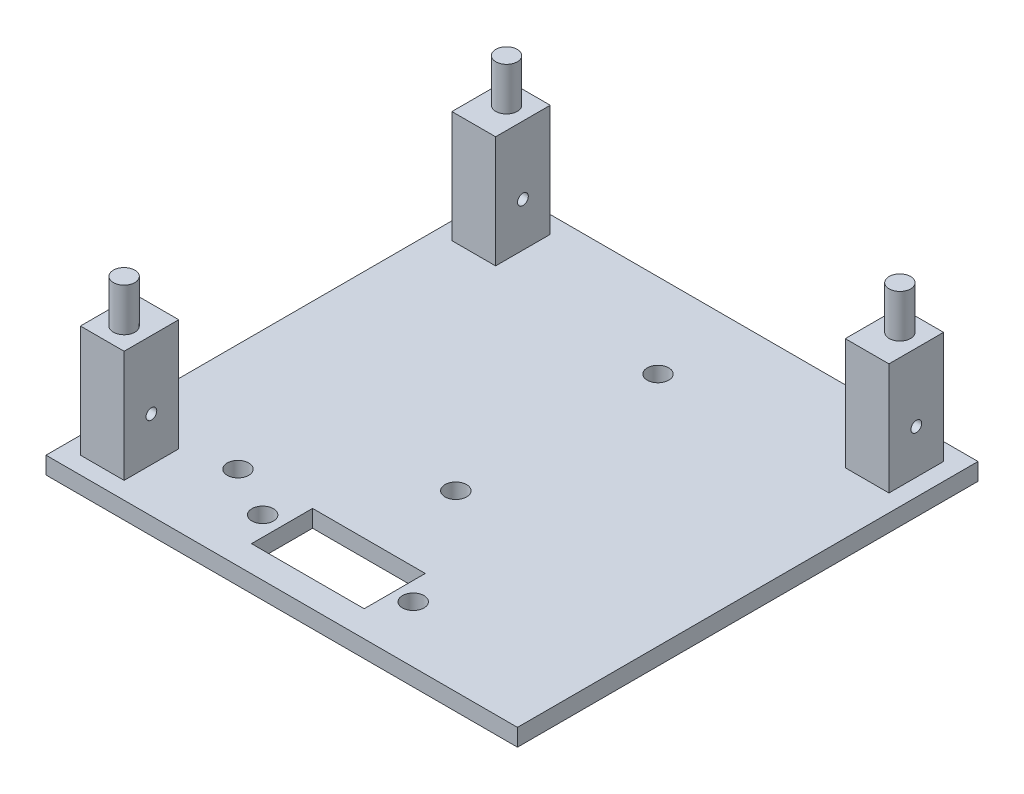
ISO-10303-21;
HEADER;
FILE_DESCRIPTION(('STEP AP214'),'2;1');
FILE_NAME('part.step','',(''),(''),'','','');
FILE_SCHEMA(('AUTOMOTIVE_DESIGN { 1 0 10303 214 1 1 1 1 }'));
ENDSEC;
DATA;
#1=APPLICATION_CONTEXT('core data for automotive mechanical design processes');
#2=APPLICATION_PROTOCOL_DEFINITION('international standard','automotive_design',2000,#1);
#3=PRODUCT_CONTEXT('',#1,'mechanical');
#4=PRODUCT('Part','Part','',(#3));
#5=PRODUCT_RELATED_PRODUCT_CATEGORY('part','',(#4));
#6=PRODUCT_DEFINITION_FORMATION('','',#4);
#7=PRODUCT_DEFINITION_CONTEXT('part definition',#1,'design');
#8=PRODUCT_DEFINITION('design','',#6,#7);
#9=PRODUCT_DEFINITION_SHAPE('','',#8);
#10=(LENGTH_UNIT() NAMED_UNIT(*) SI_UNIT(.MILLI.,.METRE.));
#11=(NAMED_UNIT(*) PLANE_ANGLE_UNIT() SI_UNIT($,.RADIAN.));
#12=(NAMED_UNIT(*) SI_UNIT($,.STERADIAN.) SOLID_ANGLE_UNIT());
#13=UNCERTAINTY_MEASURE_WITH_UNIT(LENGTH_MEASURE(1.E-05),#10,'distance_accuracy_value','');
#14=(GEOMETRIC_REPRESENTATION_CONTEXT(3) GLOBAL_UNCERTAINTY_ASSIGNED_CONTEXT((#13)) GLOBAL_UNIT_ASSIGNED_CONTEXT((#10,
#11,#12)) REPRESENTATION_CONTEXT('',''));
#15=CARTESIAN_POINT('',(0.,0.,0.));
#16=DIRECTION('',(0.,0.,1.));
#17=DIRECTION('',(1.,0.,0.));
#18=AXIS2_PLACEMENT_3D('',#15,#16,#17);
#19=CARTESIAN_POINT('',(0.,15.,0.));
#20=DIRECTION('',(0.,1.,0.));
#21=DIRECTION('',(0.,0.,1.));
#22=AXIS2_PLACEMENT_3D('',#19,#20,#21);
#23=PLANE('',#22);
#24=DIRECTION('',(0.,0.,1.));
#25=VECTOR('',#24,1.);
#26=CARTESIAN_POINT('',(-25.4,15.,24.765));
#27=LINE('',#26,#25);
#28=CARTESIAN_POINT('',(-25.4,15.,18.415));
#29=VERTEX_POINT('',#28);
#30=CARTESIAN_POINT('',(-25.4,15.,24.765));
#31=VERTEX_POINT('',#30);
#32=EDGE_CURVE('E222',#29,#31,#27,.T.);
#33=ORIENTED_EDGE('',*,*,#32,.T.);
#34=DIRECTION('',(1.,0.,0.));
#35=VECTOR('',#34,1.);
#36=CARTESIAN_POINT('',(-20.32,15.,24.765));
#37=LINE('',#36,#35);
#38=CARTESIAN_POINT('',(-20.32,15.,24.765));
#39=VERTEX_POINT('',#38);
#40=EDGE_CURVE('E225',#31,#39,#37,.T.);
#41=ORIENTED_EDGE('',*,*,#40,.T.);
#42=DIRECTION('',(0.,0.,-1.));
#43=VECTOR('',#42,1.);
#44=CARTESIAN_POINT('',(-20.32,15.,24.765));
#45=LINE('',#44,#43);
#46=CARTESIAN_POINT('',(-20.32,15.,18.415));
#47=VERTEX_POINT('',#46);
#48=EDGE_CURVE('E228',#39,#47,#45,.T.);
#49=ORIENTED_EDGE('',*,*,#48,.T.);
#50=DIRECTION('',(-1.,0.,0.));
#51=VECTOR('',#50,1.);
#52=CARTESIAN_POINT('',(-20.32,15.,18.415));
#53=LINE('',#52,#51);
#54=EDGE_CURVE('E230',#47,#29,#53,.T.);
#55=ORIENTED_EDGE('',*,*,#54,.T.);
#56=EDGE_LOOP('',(#33,#41,#49,#55));
#57=FACE_BOUND('',#56,.T.);
#58=CARTESIAN_POINT('',(-22.86,15.,22.225));
#59=DIRECTION('',(0.,1.,0.));
#60=DIRECTION('',(0.,0.,1.));
#61=AXIS2_PLACEMENT_3D('',#58,#59,#60);
#62=CIRCLE('',#61,1.25);
#63=CARTESIAN_POINT('',(-22.86,15.,23.475));
#64=VERTEX_POINT('',#63);
#65=EDGE_CURVE('E175',#64,#64,#62,.T.);
#66=ORIENTED_EDGE('',*,*,#65,.F.);
#67=EDGE_LOOP('',(#66));
#68=FACE_BOUND('',#67,.T.);
#69=ADVANCED_FACE('F32',(#57,#68),#23,.T.);
#70=CARTESIAN_POINT('',(0.,15.,0.));
#71=DIRECTION('',(0.,1.,0.));
#72=DIRECTION('',(0.,0.,1.));
#73=AXIS2_PLACEMENT_3D('',#70,#71,#72);
#74=PLANE('',#73);
#75=DIRECTION('',(0.,0.,1.));
#76=VECTOR('',#75,1.);
#77=CARTESIAN_POINT('',(20.32,15.,-18.415));
#78=LINE('',#77,#76);
#79=CARTESIAN_POINT('',(20.32,15.,-24.765));
#80=VERTEX_POINT('',#79);
#81=CARTESIAN_POINT('',(20.32,15.,-18.415));
#82=VERTEX_POINT('',#81);
#83=EDGE_CURVE('E251',#80,#82,#78,.T.);
#84=ORIENTED_EDGE('',*,*,#83,.T.);
#85=DIRECTION('',(1.,0.,0.));
#86=VECTOR('',#85,1.);
#87=CARTESIAN_POINT('',(25.4,15.,-18.415));
#88=LINE('',#87,#86);
#89=CARTESIAN_POINT('',(25.4,15.,-18.415));
#90=VERTEX_POINT('',#89);
#91=EDGE_CURVE('E254',#82,#90,#88,.T.);
#92=ORIENTED_EDGE('',*,*,#91,.T.);
#93=DIRECTION('',(0.,0.,-1.));
#94=VECTOR('',#93,1.);
#95=CARTESIAN_POINT('',(25.4,15.,-18.415));
#96=LINE('',#95,#94);
#97=CARTESIAN_POINT('',(25.4,15.,-24.765));
#98=VERTEX_POINT('',#97);
#99=EDGE_CURVE('E257',#90,#98,#96,.T.);
#100=ORIENTED_EDGE('',*,*,#99,.T.);
#101=DIRECTION('',(-1.,0.,0.));
#102=VECTOR('',#101,1.);
#103=CARTESIAN_POINT('',(25.4,15.,-24.765));
#104=LINE('',#103,#102);
#105=EDGE_CURVE('E259',#98,#80,#104,.T.);
#106=ORIENTED_EDGE('',*,*,#105,.T.);
#107=EDGE_LOOP('',(#84,#92,#100,#106));
#108=FACE_BOUND('',#107,.T.);
#109=CARTESIAN_POINT('',(22.86,15.,-22.225));
#110=DIRECTION('',(0.,1.,0.));
#111=DIRECTION('',(0.,0.,1.));
#112=AXIS2_PLACEMENT_3D('',#109,#110,#111);
#113=CIRCLE('',#112,1.25);
#114=CARTESIAN_POINT('',(22.86,15.,-20.975));
#115=VERTEX_POINT('',#114);
#116=EDGE_CURVE('E207',#115,#115,#113,.T.);
#117=ORIENTED_EDGE('',*,*,#116,.F.);
#118=EDGE_LOOP('',(#117));
#119=FACE_BOUND('',#118,.T.);
#120=ADVANCED_FACE('F360',(#108,#119),#74,.T.);
#121=CARTESIAN_POINT('',(0.,15.,0.));
#122=DIRECTION('',(0.,1.,0.));
#123=DIRECTION('',(0.,0.,1.));
#124=AXIS2_PLACEMENT_3D('',#121,#122,#123);
#125=PLANE('',#124);
#126=DIRECTION('',(0.,0.,1.));
#127=VECTOR('',#126,1.);
#128=CARTESIAN_POINT('',(-25.4,15.,-18.415));
#129=LINE('',#128,#127);
#130=CARTESIAN_POINT('',(-25.4,15.,-24.765));
#131=VERTEX_POINT('',#130);
#132=CARTESIAN_POINT('',(-25.4,15.,-18.415));
#133=VERTEX_POINT('',#132);
#134=EDGE_CURVE('E280',#131,#133,#129,.T.);
#135=ORIENTED_EDGE('',*,*,#134,.T.);
#136=DIRECTION('',(1.,0.,0.));
#137=VECTOR('',#136,1.);
#138=CARTESIAN_POINT('',(-20.32,15.,-18.415));
#139=LINE('',#138,#137);
#140=CARTESIAN_POINT('',(-20.32,15.,-18.415));
#141=VERTEX_POINT('',#140);
#142=EDGE_CURVE('E283',#133,#141,#139,.T.);
#143=ORIENTED_EDGE('',*,*,#142,.T.);
#144=DIRECTION('',(0.,0.,-1.));
#145=VECTOR('',#144,1.);
#146=CARTESIAN_POINT('',(-20.32,15.,-18.415));
#147=LINE('',#146,#145);
#148=CARTESIAN_POINT('',(-20.32,15.,-24.765));
#149=VERTEX_POINT('',#148);
#150=EDGE_CURVE('E286',#141,#149,#147,.T.);
#151=ORIENTED_EDGE('',*,*,#150,.T.);
#152=DIRECTION('',(-1.,0.,0.));
#153=VECTOR('',#152,1.);
#154=CARTESIAN_POINT('',(-20.32,15.,-24.765));
#155=LINE('',#154,#153);
#156=EDGE_CURVE('E288',#149,#131,#155,.T.);
#157=ORIENTED_EDGE('',*,*,#156,.T.);
#158=EDGE_LOOP('',(#135,#143,#151,#157));
#159=FACE_BOUND('',#158,.T.);
#160=CARTESIAN_POINT('',(-22.86,15.,-22.225));
#161=DIRECTION('',(0.,1.,0.));
#162=DIRECTION('',(0.,0.,1.));
#163=AXIS2_PLACEMENT_3D('',#160,#161,#162);
#164=CIRCLE('',#163,1.25);
#165=CARTESIAN_POINT('',(-22.86,15.,-20.975));
#166=VERTEX_POINT('',#165);
#167=EDGE_CURVE('E213',#166,#166,#164,.T.);
#168=ORIENTED_EDGE('',*,*,#167,.F.);
#169=EDGE_LOOP('',(#168));
#170=FACE_BOUND('',#169,.T.);
#171=ADVANCED_FACE('F366',(#159,#170),#125,.T.);
#172=CARTESIAN_POINT('',(0.,2.,0.));
#173=DIRECTION('',(0.,1.,0.));
#174=DIRECTION('',(0.,0.,1.));
#175=AXIS2_PLACEMENT_3D('',#172,#173,#174);
#176=PLANE('',#175);
#177=CARTESIAN_POINT('',(8.7,2.,20.1805963193399));
#178=DIRECTION('',(0.,1.,0.));
#179=DIRECTION('',(0.,0.,1.));
#180=AXIS2_PLACEMENT_3D('',#177,#178,#179);
#181=CIRCLE('',#180,1.25);
#182=CARTESIAN_POINT('',(8.7,2.,21.4305963193399));
#183=VERTEX_POINT('',#182);
#184=EDGE_CURVE('E730',#183,#183,#181,.T.);
#185=ORIENTED_EDGE('',*,*,#184,.F.);
#186=EDGE_LOOP('',(#185));
#187=FACE_BOUND('',#186,.T.);
#188=CARTESIAN_POINT('',(-8.8,2.,20.1805963193399));
#189=DIRECTION('',(0.,1.,0.));
#190=DIRECTION('',(0.,0.,1.));
#191=AXIS2_PLACEMENT_3D('',#188,#189,#190);
#192=CIRCLE('',#191,1.25);
#193=CARTESIAN_POINT('',(-8.8,2.,21.4305963193399));
#194=VERTEX_POINT('',#193);
#195=EDGE_CURVE('E734',#194,#194,#192,.T.);
#196=ORIENTED_EDGE('',*,*,#195,.F.);
#197=EDGE_LOOP('',(#196));
#198=FACE_BOUND('',#197,.T.);
#199=CARTESIAN_POINT('',(-14.8354654023255,2.,17.0171514909028));
#200=DIRECTION('',(0.,1.,0.));
#201=DIRECTION('',(0.,0.,1.));
#202=AXIS2_PLACEMENT_3D('',#199,#200,#201);
#203=CIRCLE('',#202,1.25);
#204=CARTESIAN_POINT('',(-14.8354654023255,2.,18.2671514909028));
#205=VERTEX_POINT('',#204);
#206=EDGE_CURVE('E743',#205,#205,#203,.T.);
#207=ORIENTED_EDGE('',*,*,#206,.F.);
#208=EDGE_LOOP('',(#207));
#209=FACE_BOUND('',#208,.T.);
#210=CARTESIAN_POINT('',(0.,2.,-16.9691941928565));
#211=DIRECTION('',(0.,1.,0.));
#212=DIRECTION('',(0.,0.,1.));
#213=AXIS2_PLACEMENT_3D('',#210,#211,#212);
#214=CIRCLE('',#213,1.25);
#215=CARTESIAN_POINT('',(0.,2.,-15.7191941928565));
#216=VERTEX_POINT('',#215);
#217=EDGE_CURVE('E765',#216,#216,#214,.F.);
#218=ORIENTED_EDGE('',*,*,#217,.T.);
#219=EDGE_LOOP('',(#218));
#220=FACE_BOUND('',#219,.T.);
#221=CARTESIAN_POINT('',(0.,2.,6.53080580714353));
#222=DIRECTION('',(0.,1.,0.));
#223=DIRECTION('',(0.,0.,1.));
#224=AXIS2_PLACEMENT_3D('',#221,#222,#223);
#225=CIRCLE('',#224,1.25);
#226=CARTESIAN_POINT('',(0.,2.,7.78080580714353));
#227=VERTEX_POINT('',#226);
#228=EDGE_CURVE('E771',#227,#227,#225,.F.);
#229=ORIENTED_EDGE('',*,*,#228,.T.);
#230=EDGE_LOOP('',(#229));
#231=FACE_BOUND('',#230,.T.);
#232=DIRECTION('',(0.,0.,1.));
#233=VECTOR('',#232,1.);
#234=CARTESIAN_POINT('',(6.55,2.,23.7305963193399));
#235=LINE('',#234,#233);
#236=CARTESIAN_POINT('',(6.55,2.,16.6305963193399));
#237=VERTEX_POINT('',#236);
#238=CARTESIAN_POINT('',(6.55,2.,23.7305963193399));
#239=VERTEX_POINT('',#238);
#240=EDGE_CURVE('E179',#237,#239,#235,.T.);
#241=ORIENTED_EDGE('',*,*,#240,.T.);
#242=DIRECTION('',(-1.,0.,0.));
#243=VECTOR('',#242,1.);
#244=CARTESIAN_POINT('',(-6.55,2.,23.7305963193399));
#245=LINE('',#244,#243);
#246=CARTESIAN_POINT('',(-6.55,2.,23.7305963193399));
#247=VERTEX_POINT('',#246);
#248=EDGE_CURVE('E168',#239,#247,#245,.T.);
#249=ORIENTED_EDGE('',*,*,#248,.T.);
#250=DIRECTION('',(0.,0.,-1.));
#251=VECTOR('',#250,1.);
#252=CARTESIAN_POINT('',(-6.55,2.,23.7305963193399));
#253=LINE('',#252,#251);
#254=CARTESIAN_POINT('',(-6.55,2.,16.6305963193399));
#255=VERTEX_POINT('',#254);
#256=EDGE_CURVE('E190',#247,#255,#253,.T.);
#257=ORIENTED_EDGE('',*,*,#256,.T.);
#258=DIRECTION('',(1.,0.,0.));
#259=VECTOR('',#258,1.);
#260=CARTESIAN_POINT('',(-6.55,2.,16.6305963193399));
#261=LINE('',#260,#259);
#262=EDGE_CURVE('E186',#255,#237,#261,.T.);
#263=ORIENTED_EDGE('',*,*,#262,.T.);
#264=EDGE_LOOP('',(#241,#249,#257,#263));
#265=FACE_BOUND('',#264,.T.);
#266=DIRECTION('',(1.,0.,0.));
#267=VECTOR('',#266,1.);
#268=CARTESIAN_POINT('',(25.4,2.,-18.415));
#269=LINE('',#268,#267);
#270=CARTESIAN_POINT('',(20.32,2.,-18.415));
#271=VERTEX_POINT('',#270);
#272=CARTESIAN_POINT('',(25.4,2.,-18.415));
#273=VERTEX_POINT('',#272);
#274=EDGE_CURVE('E264',#271,#273,#269,.T.);
#275=ORIENTED_EDGE('',*,*,#274,.F.);
#276=DIRECTION('',(0.,0.,1.));
#277=VECTOR('',#276,1.);
#278=CARTESIAN_POINT('',(20.32,2.,-18.415));
#279=LINE('',#278,#277);
#280=CARTESIAN_POINT('',(20.32,2.,-24.765));
#281=VERTEX_POINT('',#280);
#282=EDGE_CURVE('E250',#281,#271,#279,.T.);
#283=ORIENTED_EDGE('',*,*,#282,.F.);
#284=DIRECTION('',(-1.,0.,0.));
#285=VECTOR('',#284,1.);
#286=CARTESIAN_POINT('',(25.4,2.,-24.765));
#287=LINE('',#286,#285);
#288=CARTESIAN_POINT('',(25.4,2.,-24.765));
#289=VERTEX_POINT('',#288);
#290=EDGE_CURVE('E255',#289,#281,#287,.T.);
#291=ORIENTED_EDGE('',*,*,#290,.F.);
#292=DIRECTION('',(0.,0.,-1.));
#293=VECTOR('',#292,1.);
#294=CARTESIAN_POINT('',(25.4,2.,-18.415));
#295=LINE('',#294,#293);
#296=EDGE_CURVE('E266',#273,#289,#295,.T.);
#297=ORIENTED_EDGE('',*,*,#296,.F.);
#298=EDGE_LOOP('',(#275,#283,#291,#297));
#299=FACE_BOUND('',#298,.T.);
#300=DIRECTION('',(0.,0.,1.));
#301=VECTOR('',#300,1.);
#302=CARTESIAN_POINT('',(-27.4,2.,26.765));
#303=LINE('',#302,#301);
#304=CARTESIAN_POINT('',(-27.4,2.,-26.765));
#305=VERTEX_POINT('',#304);
#306=CARTESIAN_POINT('',(-27.4,2.,26.765));
#307=VERTEX_POINT('',#306);
#308=EDGE_CURVE('E309',#305,#307,#303,.T.);
#309=ORIENTED_EDGE('',*,*,#308,.T.);
#310=DIRECTION('',(1.,0.,0.));
#311=VECTOR('',#310,1.);
#312=CARTESIAN_POINT('',(27.4,2.,26.765));
#313=LINE('',#312,#311);
#314=CARTESIAN_POINT('',(27.4,2.,26.765));
#315=VERTEX_POINT('',#314);
#316=EDGE_CURVE('E312',#307,#315,#313,.T.);
#317=ORIENTED_EDGE('',*,*,#316,.T.);
#318=DIRECTION('',(0.,0.,-1.));
#319=VECTOR('',#318,1.);
#320=CARTESIAN_POINT('',(27.4,2.,26.765));
#321=LINE('',#320,#319);
#322=CARTESIAN_POINT('',(27.4,2.,-26.765));
#323=VERTEX_POINT('',#322);
#324=EDGE_CURVE('E315',#315,#323,#321,.T.);
#325=ORIENTED_EDGE('',*,*,#324,.T.);
#326=DIRECTION('',(-1.,0.,0.));
#327=VECTOR('',#326,1.);
#328=CARTESIAN_POINT('',(27.4,2.,-26.765));
#329=LINE('',#328,#327);
#330=EDGE_CURVE('E317',#323,#305,#329,.T.);
#331=ORIENTED_EDGE('',*,*,#330,.T.);
#332=EDGE_LOOP('',(#309,#317,#325,#331));
#333=FACE_BOUND('',#332,.T.);
#334=DIRECTION('',(1.,0.,0.));
#335=VECTOR('',#334,1.);
#336=CARTESIAN_POINT('',(-20.32,2.,-18.415));
#337=LINE('',#336,#335);
#338=CARTESIAN_POINT('',(-25.4,2.,-18.415));
#339=VERTEX_POINT('',#338);
#340=CARTESIAN_POINT('',(-20.32,2.,-18.415));
#341=VERTEX_POINT('',#340);
#342=EDGE_CURVE('E293',#339,#341,#337,.T.);
#343=ORIENTED_EDGE('',*,*,#342,.F.);
#344=DIRECTION('',(0.,0.,1.));
#345=VECTOR('',#344,1.);
#346=CARTESIAN_POINT('',(-25.4,2.,-18.415));
#347=LINE('',#346,#345);
#348=CARTESIAN_POINT('',(-25.4,2.,-24.765));
#349=VERTEX_POINT('',#348);
#350=EDGE_CURVE('E279',#349,#339,#347,.T.);
#351=ORIENTED_EDGE('',*,*,#350,.F.);
#352=DIRECTION('',(-1.,0.,0.));
#353=VECTOR('',#352,1.);
#354=CARTESIAN_POINT('',(-20.32,2.,-24.765));
#355=LINE('',#354,#353);
#356=CARTESIAN_POINT('',(-20.32,2.,-24.765));
#357=VERTEX_POINT('',#356);
#358=EDGE_CURVE('E284',#357,#349,#355,.T.);
#359=ORIENTED_EDGE('',*,*,#358,.F.);
#360=DIRECTION('',(0.,0.,-1.));
#361=VECTOR('',#360,1.);
#362=CARTESIAN_POINT('',(-20.32,2.,-18.415));
#363=LINE('',#362,#361);
#364=EDGE_CURVE('E295',#341,#357,#363,.T.);
#365=ORIENTED_EDGE('',*,*,#364,.F.);
#366=EDGE_LOOP('',(#343,#351,#359,#365));
#367=FACE_BOUND('',#366,.T.);
#368=DIRECTION('',(1.,0.,0.));
#369=VECTOR('',#368,1.);
#370=CARTESIAN_POINT('',(-20.32,2.,24.765));
#371=LINE('',#370,#369);
#372=CARTESIAN_POINT('',(-25.4,2.,24.765));
#373=VERTEX_POINT('',#372);
#374=CARTESIAN_POINT('',(-20.32,2.,24.765));
#375=VERTEX_POINT('',#374);
#376=EDGE_CURVE('E235',#373,#375,#371,.T.);
#377=ORIENTED_EDGE('',*,*,#376,.F.);
#378=DIRECTION('',(0.,0.,1.));
#379=VECTOR('',#378,1.);
#380=CARTESIAN_POINT('',(-25.4,2.,24.765));
#381=LINE('',#380,#379);
#382=CARTESIAN_POINT('',(-25.4,2.,18.415));
#383=VERTEX_POINT('',#382);
#384=EDGE_CURVE('E219',#383,#373,#381,.T.);
#385=ORIENTED_EDGE('',*,*,#384,.F.);
#386=DIRECTION('',(-1.,0.,0.));
#387=VECTOR('',#386,1.);
#388=CARTESIAN_POINT('',(-20.32,2.,18.415));
#389=LINE('',#388,#387);
#390=CARTESIAN_POINT('',(-20.32,2.,18.415));
#391=VERTEX_POINT('',#390);
#392=EDGE_CURVE('E226',#391,#383,#389,.T.);
#393=ORIENTED_EDGE('',*,*,#392,.F.);
#394=DIRECTION('',(0.,0.,-1.));
#395=VECTOR('',#394,1.);
#396=CARTESIAN_POINT('',(-20.32,2.,24.765));
#397=LINE('',#396,#395);
#398=EDGE_CURVE('E237',#375,#391,#397,.T.);
#399=ORIENTED_EDGE('',*,*,#398,.F.);
#400=EDGE_LOOP('',(#377,#385,#393,#399));
#401=FACE_BOUND('',#400,.T.);
#402=ADVANCED_FACE('F184',(#187,#198,#209,#220,#231,#265,#299,#333,#367,#401),#176,.T.);
#403=CARTESIAN_POINT('',(-27.4,2.,26.765));
#404=DIRECTION('',(1.,0.,0.));
#405=DIRECTION('',(0.,0.,-1.));
#406=AXIS2_PLACEMENT_3D('',#403,#404,#405);
#407=PLANE('',#406);
#408=DIRECTION('',(0.,0.,1.));
#409=VECTOR('',#408,1.);
#410=CARTESIAN_POINT('',(-27.4,0.,26.765));
#411=LINE('',#410,#409);
#412=CARTESIAN_POINT('',(-27.4,0.,-26.765));
#413=VERTEX_POINT('',#412);
#414=CARTESIAN_POINT('',(-27.4,0.,26.765));
#415=VERTEX_POINT('',#414);
#416=EDGE_CURVE('E308',#413,#415,#411,.T.);
#417=ORIENTED_EDGE('',*,*,#416,.T.);
#418=DIRECTION('',(0.,-1.,0.));
#419=VECTOR('',#418,1.);
#420=CARTESIAN_POINT('',(-27.4,2.,26.765));
#421=LINE('',#420,#419);
#422=EDGE_CURVE('E11',#307,#415,#421,.T.);
#423=ORIENTED_EDGE('',*,*,#422,.F.);
#424=ORIENTED_EDGE('',*,*,#308,.F.);
#425=DIRECTION('',(0.,-1.,0.));
#426=VECTOR('',#425,1.);
#427=CARTESIAN_POINT('',(-27.4,2.,-26.765));
#428=LINE('',#427,#426);
#429=EDGE_CURVE('E319',#305,#413,#428,.T.);
#430=ORIENTED_EDGE('',*,*,#429,.T.);
#431=EDGE_LOOP('',(#417,#423,#424,#430));
#432=FACE_BOUND('',#431,.T.);
#433=ADVANCED_FACE('F34',(#432),#407,.F.);
#434=CARTESIAN_POINT('',(27.4,2.,26.765));
#435=DIRECTION('',(0.,0.,-1.));
#436=DIRECTION('',(-1.,0.,0.));
#437=AXIS2_PLACEMENT_3D('',#434,#435,#436);
#438=PLANE('',#437);
#439=DIRECTION('',(1.,0.,0.));
#440=VECTOR('',#439,1.);
#441=CARTESIAN_POINT('',(27.4,0.,26.765));
#442=LINE('',#441,#440);
#443=CARTESIAN_POINT('',(27.4,0.,26.765));
#444=VERTEX_POINT('',#443);
#445=EDGE_CURVE('E322',#415,#444,#442,.T.);
#446=ORIENTED_EDGE('',*,*,#445,.T.);
#447=DIRECTION('',(0.,-1.,0.));
#448=VECTOR('',#447,1.);
#449=CARTESIAN_POINT('',(27.4,2.,26.765));
#450=LINE('',#449,#448);
#451=EDGE_CURVE('E40',#315,#444,#450,.T.);
#452=ORIENTED_EDGE('',*,*,#451,.F.);
#453=ORIENTED_EDGE('',*,*,#316,.F.);
#454=ORIENTED_EDGE('',*,*,#422,.T.);
#455=EDGE_LOOP('',(#446,#452,#453,#454));
#456=FACE_BOUND('',#455,.T.);
#457=ADVANCED_FACE('F352',(#456),#438,.F.);
#458=CARTESIAN_POINT('',(27.4,2.,26.765));
#459=DIRECTION('',(-1.,0.,0.));
#460=DIRECTION('',(0.,0.,1.));
#461=AXIS2_PLACEMENT_3D('',#458,#459,#460);
#462=PLANE('',#461);
#463=DIRECTION('',(0.,0.,-1.));
#464=VECTOR('',#463,1.);
#465=CARTESIAN_POINT('',(27.4,0.,26.765));
#466=LINE('',#465,#464);
#467=CARTESIAN_POINT('',(27.4,0.,-26.765));
#468=VERTEX_POINT('',#467);
#469=EDGE_CURVE('E324',#444,#468,#466,.T.);
#470=ORIENTED_EDGE('',*,*,#469,.T.);
#471=DIRECTION('',(0.,-1.,0.));
#472=VECTOR('',#471,1.);
#473=CARTESIAN_POINT('',(27.4,2.,-26.765));
#474=LINE('',#473,#472);
#475=EDGE_CURVE('E329',#323,#468,#474,.T.);
#476=ORIENTED_EDGE('',*,*,#475,.F.);
#477=ORIENTED_EDGE('',*,*,#324,.F.);
#478=ORIENTED_EDGE('',*,*,#451,.T.);
#479=EDGE_LOOP('',(#470,#476,#477,#478));
#480=FACE_BOUND('',#479,.T.);
#481=ADVANCED_FACE('F336',(#480),#462,.F.);
#482=CARTESIAN_POINT('',(27.4,2.,-26.765));
#483=DIRECTION('',(0.,0.,1.));
#484=DIRECTION('',(1.,0.,0.));
#485=AXIS2_PLACEMENT_3D('',#482,#483,#484);
#486=PLANE('',#485);
#487=DIRECTION('',(-1.,0.,0.));
#488=VECTOR('',#487,1.);
#489=CARTESIAN_POINT('',(27.4,0.,-26.765));
#490=LINE('',#489,#488);
#491=EDGE_CURVE('E313',#468,#413,#490,.T.);
#492=ORIENTED_EDGE('',*,*,#491,.T.);
#493=ORIENTED_EDGE('',*,*,#429,.F.);
#494=ORIENTED_EDGE('',*,*,#330,.F.);
#495=ORIENTED_EDGE('',*,*,#475,.T.);
#496=EDGE_LOOP('',(#492,#493,#494,#495));
#497=FACE_BOUND('',#496,.T.);
#498=ADVANCED_FACE('F345',(#497),#486,.F.);
#499=CARTESIAN_POINT('',(0.,0.,0.));
#500=DIRECTION('',(0.,1.,0.));
#501=DIRECTION('',(0.,0.,1.));
#502=AXIS2_PLACEMENT_3D('',#499,#500,#501);
#503=PLANE('',#502);
#504=CARTESIAN_POINT('',(8.7,0.,20.1805963193399));
#505=DIRECTION('',(0.,1.,0.));
#506=DIRECTION('',(0.,0.,1.));
#507=AXIS2_PLACEMENT_3D('',#504,#505,#506);
#508=CIRCLE('',#507,1.25);
#509=CARTESIAN_POINT('',(8.7,0.,21.4305963193399));
#510=VERTEX_POINT('',#509);
#511=EDGE_CURVE('E733',#510,#510,#508,.F.);
#512=ORIENTED_EDGE('',*,*,#511,.F.);
#513=EDGE_LOOP('',(#512));
#514=FACE_BOUND('',#513,.T.);
#515=CARTESIAN_POINT('',(-8.8,0.,20.1805963193399));
#516=DIRECTION('',(0.,1.,0.));
#517=DIRECTION('',(0.,0.,1.));
#518=AXIS2_PLACEMENT_3D('',#515,#516,#517);
#519=CIRCLE('',#518,1.25);
#520=CARTESIAN_POINT('',(-8.8,0.,21.4305963193399));
#521=VERTEX_POINT('',#520);
#522=EDGE_CURVE('E737',#521,#521,#519,.F.);
#523=ORIENTED_EDGE('',*,*,#522,.F.);
#524=EDGE_LOOP('',(#523));
#525=FACE_BOUND('',#524,.T.);
#526=CARTESIAN_POINT('',(-14.8354654023255,0.,17.0171514909028));
#527=DIRECTION('',(0.,1.,0.));
#528=DIRECTION('',(0.,0.,1.));
#529=AXIS2_PLACEMENT_3D('',#526,#527,#528);
#530=CIRCLE('',#529,1.25);
#531=CARTESIAN_POINT('',(-14.8354654023255,0.,18.2671514909028));
#532=VERTEX_POINT('',#531);
#533=EDGE_CURVE('E746',#532,#532,#530,.F.);
#534=ORIENTED_EDGE('',*,*,#533,.F.);
#535=EDGE_LOOP('',(#534));
#536=FACE_BOUND('',#535,.T.);
#537=CARTESIAN_POINT('',(0.,0.,-16.9691941928565));
#538=DIRECTION('',(0.,-1.,0.));
#539=DIRECTION('',(0.,0.,-1.));
#540=AXIS2_PLACEMENT_3D('',#537,#538,#539);
#541=CIRCLE('',#540,1.25);
#542=CARTESIAN_POINT('',(0.,0.,-18.2191941928565));
#543=VERTEX_POINT('',#542);
#544=EDGE_CURVE('E768',#543,#543,#541,.T.);
#545=ORIENTED_EDGE('',*,*,#544,.F.);
#546=EDGE_LOOP('',(#545));
#547=FACE_BOUND('',#546,.T.);
#548=CARTESIAN_POINT('',(0.,0.,6.53080580714353));
#549=DIRECTION('',(0.,-1.,0.));
#550=DIRECTION('',(0.,0.,-1.));
#551=AXIS2_PLACEMENT_3D('',#548,#549,#550);
#552=CIRCLE('',#551,1.25);
#553=CARTESIAN_POINT('',(0.,0.,5.28080580714353));
#554=VERTEX_POINT('',#553);
#555=EDGE_CURVE('E774',#554,#554,#552,.T.);
#556=ORIENTED_EDGE('',*,*,#555,.F.);
#557=EDGE_LOOP('',(#556));
#558=FACE_BOUND('',#557,.T.);
#559=DIRECTION('',(-1.,0.,0.));
#560=VECTOR('',#559,1.);
#561=CARTESIAN_POINT('',(-6.55,0.,23.7305963193399));
#562=LINE('',#561,#560);
#563=CARTESIAN_POINT('',(6.55,0.,23.7305963193399));
#564=VERTEX_POINT('',#563);
#565=CARTESIAN_POINT('',(-6.55,0.,23.7305963193399));
#566=VERTEX_POINT('',#565);
#567=EDGE_CURVE('E188',#564,#566,#562,.T.);
#568=ORIENTED_EDGE('',*,*,#567,.F.);
#569=DIRECTION('',(0.,0.,1.));
#570=VECTOR('',#569,1.);
#571=CARTESIAN_POINT('',(6.55,0.,23.7305963193399));
#572=LINE('',#571,#570);
#573=CARTESIAN_POINT('',(6.55,0.,16.6305963193399));
#574=VERTEX_POINT('',#573);
#575=EDGE_CURVE('E55',#574,#564,#572,.T.);
#576=ORIENTED_EDGE('',*,*,#575,.F.);
#577=DIRECTION('',(1.,0.,0.));
#578=VECTOR('',#577,1.);
#579=CARTESIAN_POINT('',(-6.55,0.,16.6305963193399));
#580=LINE('',#579,#578);
#581=CARTESIAN_POINT('',(-6.55,0.,16.6305963193399));
#582=VERTEX_POINT('',#581);
#583=EDGE_CURVE('E181',#582,#574,#580,.T.);
#584=ORIENTED_EDGE('',*,*,#583,.F.);
#585=DIRECTION('',(0.,0.,-1.));
#586=VECTOR('',#585,1.);
#587=CARTESIAN_POINT('',(-6.55,0.,23.7305963193399));
#588=LINE('',#587,#586);
#589=EDGE_CURVE('E195',#566,#582,#588,.T.);
#590=ORIENTED_EDGE('',*,*,#589,.F.);
#591=EDGE_LOOP('',(#568,#576,#584,#590));
#592=FACE_BOUND('',#591,.T.);
#593=ORIENTED_EDGE('',*,*,#416,.F.);
#594=ORIENTED_EDGE('',*,*,#491,.F.);
#595=ORIENTED_EDGE('',*,*,#469,.F.);
#596=ORIENTED_EDGE('',*,*,#445,.F.);
#597=EDGE_LOOP('',(#593,#594,#595,#596));
#598=FACE_BOUND('',#597,.T.);
#599=ADVANCED_FACE('F342',(#514,#525,#536,#547,#558,#592,#598),#503,.F.);
#600=CARTESIAN_POINT('',(-25.4,15.,-18.415));
#601=DIRECTION('',(1.,0.,0.));
#602=DIRECTION('',(0.,0.,-1.));
#603=AXIS2_PLACEMENT_3D('',#600,#601,#602);
#604=PLANE('',#603);
#605=CARTESIAN_POINT('',(-25.4,7.1147059503016,-21.59));
#606=DIRECTION('',(-1.,0.,0.));
#607=DIRECTION('',(0.,0.,1.));
#608=AXIS2_PLACEMENT_3D('',#605,#606,#607);
#609=CIRCLE('',#608,0.625000000000003);
#610=CARTESIAN_POINT('',(-25.4,7.1147059503016,-20.965));
#611=VERTEX_POINT('',#610);
#612=EDGE_CURVE('E759',#611,#611,#609,.T.);
#613=ORIENTED_EDGE('',*,*,#612,.F.);
#614=EDGE_LOOP('',(#613));
#615=FACE_BOUND('',#614,.T.);
#616=ORIENTED_EDGE('',*,*,#350,.T.);
#617=DIRECTION('',(0.,-1.,0.));
#618=VECTOR('',#617,1.);
#619=CARTESIAN_POINT('',(-25.4,15.,-18.415));
#620=LINE('',#619,#618);
#621=EDGE_CURVE('E306',#133,#339,#620,.T.);
#622=ORIENTED_EDGE('',*,*,#621,.F.);
#623=ORIENTED_EDGE('',*,*,#134,.F.);
#624=DIRECTION('',(0.,-1.,0.));
#625=VECTOR('',#624,1.);
#626=CARTESIAN_POINT('',(-25.4,15.,-24.765));
#627=LINE('',#626,#625);
#628=EDGE_CURVE('E290',#131,#349,#627,.T.);
#629=ORIENTED_EDGE('',*,*,#628,.T.);
#630=EDGE_LOOP('',(#616,#622,#623,#629));
#631=FACE_BOUND('',#630,.T.);
#632=ADVANCED_FACE('F420',(#615,#631),#604,.F.);
#633=CARTESIAN_POINT('',(-20.32,15.,-18.415));
#634=DIRECTION('',(0.,0.,-1.));
#635=DIRECTION('',(-1.,0.,0.));
#636=AXIS2_PLACEMENT_3D('',#633,#634,#635);
#637=PLANE('',#636);
#638=ORIENTED_EDGE('',*,*,#342,.T.);
#639=DIRECTION('',(0.,-1.,0.));
#640=VECTOR('',#639,1.);
#641=CARTESIAN_POINT('',(-20.32,15.,-18.415));
#642=LINE('',#641,#640);
#643=EDGE_CURVE('E303',#141,#341,#642,.T.);
#644=ORIENTED_EDGE('',*,*,#643,.F.);
#645=ORIENTED_EDGE('',*,*,#142,.F.);
#646=ORIENTED_EDGE('',*,*,#621,.T.);
#647=EDGE_LOOP('',(#638,#644,#645,#646));
#648=FACE_BOUND('',#647,.T.);
#649=ADVANCED_FACE('F416',(#648),#637,.F.);
#650=CARTESIAN_POINT('',(-20.32,15.,-18.415));
#651=DIRECTION('',(-1.,0.,0.));
#652=DIRECTION('',(0.,0.,1.));
#653=AXIS2_PLACEMENT_3D('',#650,#651,#652);
#654=PLANE('',#653);
#655=CARTESIAN_POINT('',(-20.32,7.1147059503016,-21.59));
#656=DIRECTION('',(-1.,0.,0.));
#657=DIRECTION('',(0.,0.,1.));
#658=AXIS2_PLACEMENT_3D('',#655,#656,#657);
#659=CIRCLE('',#658,0.625000000000003);
#660=CARTESIAN_POINT('',(-20.32,7.1147059503016,-20.965));
#661=VERTEX_POINT('',#660);
#662=EDGE_CURVE('E762',#661,#661,#659,.F.);
#663=ORIENTED_EDGE('',*,*,#662,.F.);
#664=EDGE_LOOP('',(#663));
#665=FACE_BOUND('',#664,.T.);
#666=ORIENTED_EDGE('',*,*,#364,.T.);
#667=DIRECTION('',(0.,-1.,0.));
#668=VECTOR('',#667,1.);
#669=CARTESIAN_POINT('',(-20.32,15.,-24.765));
#670=LINE('',#669,#668);
#671=EDGE_CURVE('E301',#149,#357,#670,.T.);
#672=ORIENTED_EDGE('',*,*,#671,.F.);
#673=ORIENTED_EDGE('',*,*,#150,.F.);
#674=ORIENTED_EDGE('',*,*,#643,.T.);
#675=EDGE_LOOP('',(#666,#672,#673,#674));
#676=FACE_BOUND('',#675,.T.);
#677=ADVANCED_FACE('F412',(#665,#676),#654,.F.);
#678=CARTESIAN_POINT('',(-20.32,15.,-24.765));
#679=DIRECTION('',(0.,0.,1.));
#680=DIRECTION('',(1.,0.,0.));
#681=AXIS2_PLACEMENT_3D('',#678,#679,#680);
#682=PLANE('',#681);
#683=ORIENTED_EDGE('',*,*,#358,.T.);
#684=ORIENTED_EDGE('',*,*,#628,.F.);
#685=ORIENTED_EDGE('',*,*,#156,.F.);
#686=ORIENTED_EDGE('',*,*,#671,.T.);
#687=EDGE_LOOP('',(#683,#684,#685,#686));
#688=FACE_BOUND('',#687,.T.);
#689=ADVANCED_FACE('F405',(#688),#682,.F.);
#690=CARTESIAN_POINT('',(20.32,15.,-18.415));
#691=DIRECTION('',(1.,0.,0.));
#692=DIRECTION('',(0.,0.,-1.));
#693=AXIS2_PLACEMENT_3D('',#690,#691,#692);
#694=PLANE('',#693);
#695=CARTESIAN_POINT('',(20.32,7.11,-21.595));
#696=DIRECTION('',(1.,0.,0.));
#697=DIRECTION('',(0.,0.,-1.));
#698=AXIS2_PLACEMENT_3D('',#695,#696,#697);
#699=CIRCLE('',#698,0.625000000000003);
#700=CARTESIAN_POINT('',(20.32,7.11,-22.22));
#701=VERTEX_POINT('',#700);
#702=EDGE_CURVE('E756',#701,#701,#699,.F.);
#703=ORIENTED_EDGE('',*,*,#702,.F.);
#704=EDGE_LOOP('',(#703));
#705=FACE_BOUND('',#704,.T.);
#706=ORIENTED_EDGE('',*,*,#282,.T.);
#707=DIRECTION('',(0.,-1.,0.));
#708=VECTOR('',#707,1.);
#709=CARTESIAN_POINT('',(20.32,15.,-18.415));
#710=LINE('',#709,#708);
#711=EDGE_CURVE('E277',#82,#271,#710,.T.);
#712=ORIENTED_EDGE('',*,*,#711,.F.);
#713=ORIENTED_EDGE('',*,*,#83,.F.);
#714=DIRECTION('',(0.,-1.,0.));
#715=VECTOR('',#714,1.);
#716=CARTESIAN_POINT('',(20.32,15.,-24.765));
#717=LINE('',#716,#715);
#718=EDGE_CURVE('E261',#80,#281,#717,.T.);
#719=ORIENTED_EDGE('',*,*,#718,.T.);
#720=EDGE_LOOP('',(#706,#712,#713,#719));
#721=FACE_BOUND('',#720,.T.);
#722=ADVANCED_FACE('F401',(#705,#721),#694,.F.);
#723=CARTESIAN_POINT('',(25.4,15.,-18.415));
#724=DIRECTION('',(0.,0.,-1.));
#725=DIRECTION('',(-1.,0.,0.));
#726=AXIS2_PLACEMENT_3D('',#723,#724,#725);
#727=PLANE('',#726);
#728=ORIENTED_EDGE('',*,*,#274,.T.);
#729=DIRECTION('',(0.,-1.,0.));
#730=VECTOR('',#729,1.);
#731=CARTESIAN_POINT('',(25.4,15.,-18.415));
#732=LINE('',#731,#730);
#733=EDGE_CURVE('E274',#90,#273,#732,.T.);
#734=ORIENTED_EDGE('',*,*,#733,.F.);
#735=ORIENTED_EDGE('',*,*,#91,.F.);
#736=ORIENTED_EDGE('',*,*,#711,.T.);
#737=EDGE_LOOP('',(#728,#734,#735,#736));
#738=FACE_BOUND('',#737,.T.);
#739=ADVANCED_FACE('F397',(#738),#727,.F.);
#740=CARTESIAN_POINT('',(25.4,15.,-18.415));
#741=DIRECTION('',(-1.,0.,0.));
#742=DIRECTION('',(0.,0.,1.));
#743=AXIS2_PLACEMENT_3D('',#740,#741,#742);
#744=PLANE('',#743);
#745=CARTESIAN_POINT('',(25.4,7.11,-21.595));
#746=DIRECTION('',(1.,0.,0.));
#747=DIRECTION('',(0.,0.,-1.));
#748=AXIS2_PLACEMENT_3D('',#745,#746,#747);
#749=CIRCLE('',#748,0.625000000000003);
#750=CARTESIAN_POINT('',(25.4,7.11,-22.22));
#751=VERTEX_POINT('',#750);
#752=EDGE_CURVE('E755',#751,#751,#749,.T.);
#753=ORIENTED_EDGE('',*,*,#752,.F.);
#754=EDGE_LOOP('',(#753));
#755=FACE_BOUND('',#754,.T.);
#756=ORIENTED_EDGE('',*,*,#296,.T.);
#757=DIRECTION('',(0.,-1.,0.));
#758=VECTOR('',#757,1.);
#759=CARTESIAN_POINT('',(25.4,15.,-24.765));
#760=LINE('',#759,#758);
#761=EDGE_CURVE('E272',#98,#289,#760,.T.);
#762=ORIENTED_EDGE('',*,*,#761,.F.);
#763=ORIENTED_EDGE('',*,*,#99,.F.);
#764=ORIENTED_EDGE('',*,*,#733,.T.);
#765=EDGE_LOOP('',(#756,#762,#763,#764));
#766=FACE_BOUND('',#765,.T.);
#767=ADVANCED_FACE('F393',(#755,#766),#744,.F.);
#768=CARTESIAN_POINT('',(25.4,15.,-24.765));
#769=DIRECTION('',(0.,0.,1.));
#770=DIRECTION('',(1.,0.,0.));
#771=AXIS2_PLACEMENT_3D('',#768,#769,#770);
#772=PLANE('',#771);
#773=ORIENTED_EDGE('',*,*,#290,.T.);
#774=ORIENTED_EDGE('',*,*,#718,.F.);
#775=ORIENTED_EDGE('',*,*,#105,.F.);
#776=ORIENTED_EDGE('',*,*,#761,.T.);
#777=EDGE_LOOP('',(#773,#774,#775,#776));
#778=FACE_BOUND('',#777,.T.);
#779=ADVANCED_FACE('F388',(#778),#772,.F.);
#780=CARTESIAN_POINT('',(-25.4,15.,24.765));
#781=DIRECTION('',(1.,0.,0.));
#782=DIRECTION('',(0.,0.,-1.));
#783=AXIS2_PLACEMENT_3D('',#780,#781,#782);
#784=PLANE('',#783);
#785=CARTESIAN_POINT('',(-25.4,7.11,21.595));
#786=DIRECTION('',(-1.,0.,0.));
#787=DIRECTION('',(0.,0.,1.));
#788=AXIS2_PLACEMENT_3D('',#785,#786,#787);
#789=CIRCLE('',#788,0.625000000000003);
#790=CARTESIAN_POINT('',(-25.4,7.11,22.22));
#791=VERTEX_POINT('',#790);
#792=EDGE_CURVE('E749',#791,#791,#789,.T.);
#793=ORIENTED_EDGE('',*,*,#792,.F.);
#794=EDGE_LOOP('',(#793));
#795=FACE_BOUND('',#794,.T.);
#796=ORIENTED_EDGE('',*,*,#384,.T.);
#797=DIRECTION('',(0.,-1.,0.));
#798=VECTOR('',#797,1.);
#799=CARTESIAN_POINT('',(-25.4,15.,24.765));
#800=LINE('',#799,#798);
#801=EDGE_CURVE('E248',#31,#373,#800,.T.);
#802=ORIENTED_EDGE('',*,*,#801,.F.);
#803=ORIENTED_EDGE('',*,*,#32,.F.);
#804=DIRECTION('',(0.,-1.,0.));
#805=VECTOR('',#804,1.);
#806=CARTESIAN_POINT('',(-25.4,15.,18.415));
#807=LINE('',#806,#805);
#808=EDGE_CURVE('E232',#29,#383,#807,.T.);
#809=ORIENTED_EDGE('',*,*,#808,.T.);
#810=EDGE_LOOP('',(#796,#802,#803,#809));
#811=FACE_BOUND('',#810,.T.);
#812=ADVANCED_FACE('F385',(#795,#811),#784,.F.);
#813=CARTESIAN_POINT('',(-20.32,15.,24.765));
#814=DIRECTION('',(0.,0.,-1.));
#815=DIRECTION('',(-1.,0.,0.));
#816=AXIS2_PLACEMENT_3D('',#813,#814,#815);
#817=PLANE('',#816);
#818=ORIENTED_EDGE('',*,*,#376,.T.);
#819=DIRECTION('',(0.,-1.,0.));
#820=VECTOR('',#819,1.);
#821=CARTESIAN_POINT('',(-20.32,15.,24.765));
#822=LINE('',#821,#820);
#823=EDGE_CURVE('E245',#39,#375,#822,.T.);
#824=ORIENTED_EDGE('',*,*,#823,.F.);
#825=ORIENTED_EDGE('',*,*,#40,.F.);
#826=ORIENTED_EDGE('',*,*,#801,.T.);
#827=EDGE_LOOP('',(#818,#824,#825,#826));
#828=FACE_BOUND('',#827,.T.);
#829=ADVANCED_FACE('F381',(#828),#817,.F.);
#830=CARTESIAN_POINT('',(-20.32,15.,24.765));
#831=DIRECTION('',(-1.,0.,0.));
#832=DIRECTION('',(0.,0.,1.));
#833=AXIS2_PLACEMENT_3D('',#830,#831,#832);
#834=PLANE('',#833);
#835=CARTESIAN_POINT('',(-20.32,7.11,21.595));
#836=DIRECTION('',(-1.,0.,0.));
#837=DIRECTION('',(0.,0.,1.));
#838=AXIS2_PLACEMENT_3D('',#835,#836,#837);
#839=CIRCLE('',#838,0.625000000000003);
#840=CARTESIAN_POINT('',(-20.32,7.11,22.22));
#841=VERTEX_POINT('',#840);
#842=EDGE_CURVE('E752',#841,#841,#839,.F.);
#843=ORIENTED_EDGE('',*,*,#842,.F.);
#844=EDGE_LOOP('',(#843));
#845=FACE_BOUND('',#844,.T.);
#846=ORIENTED_EDGE('',*,*,#398,.T.);
#847=DIRECTION('',(0.,-1.,0.));
#848=VECTOR('',#847,1.);
#849=CARTESIAN_POINT('',(-20.32,15.,18.415));
#850=LINE('',#849,#848);
#851=EDGE_CURVE('E243',#47,#391,#850,.T.);
#852=ORIENTED_EDGE('',*,*,#851,.F.);
#853=ORIENTED_EDGE('',*,*,#48,.F.);
#854=ORIENTED_EDGE('',*,*,#823,.T.);
#855=EDGE_LOOP('',(#846,#852,#853,#854));
#856=FACE_BOUND('',#855,.T.);
#857=ADVANCED_FACE('F377',(#845,#856),#834,.F.);
#858=CARTESIAN_POINT('',(-20.32,15.,18.415));
#859=DIRECTION('',(0.,0.,1.));
#860=DIRECTION('',(1.,0.,0.));
#861=AXIS2_PLACEMENT_3D('',#858,#859,#860);
#862=PLANE('',#861);
#863=ORIENTED_EDGE('',*,*,#392,.T.);
#864=ORIENTED_EDGE('',*,*,#808,.F.);
#865=ORIENTED_EDGE('',*,*,#54,.F.);
#866=ORIENTED_EDGE('',*,*,#851,.T.);
#867=EDGE_LOOP('',(#863,#864,#865,#866));
#868=FACE_BOUND('',#867,.T.);
#869=ADVANCED_FACE('F374',(#868),#862,.F.);
#870=CARTESIAN_POINT('',(-22.86,20.,-22.225));
#871=DIRECTION('',(0.,-1.,0.));
#872=DIRECTION('',(0.,0.,-1.));
#873=AXIS2_PLACEMENT_3D('',#870,#871,#872);
#874=CYLINDRICAL_SURFACE('',#873,1.25);
#875=CARTESIAN_POINT('',(-22.86,20.,-22.225));
#876=DIRECTION('',(0.,1.,0.));
#877=DIRECTION('',(0.,0.,1.));
#878=AXIS2_PLACEMENT_3D('',#875,#876,#877);
#879=CIRCLE('',#878,1.25);
#880=CARTESIAN_POINT('',(-22.86,20.,-20.975));
#881=VERTEX_POINT('',#880);
#882=EDGE_CURVE('E216',#881,#881,#879,.T.);
#883=ORIENTED_EDGE('',*,*,#882,.F.);
#884=EDGE_LOOP('',(#883));
#885=FACE_BOUND('',#884,.T.);
#886=ORIENTED_EDGE('',*,*,#167,.T.);
#887=EDGE_LOOP('',(#886));
#888=FACE_BOUND('',#887,.T.);
#889=ADVANCED_FACE('F372',(#885,#888),#874,.T.);
#890=CARTESIAN_POINT('',(-22.86,20.,-22.225));
#891=DIRECTION('',(0.,1.,0.));
#892=DIRECTION('',(0.,0.,1.));
#893=AXIS2_PLACEMENT_3D('',#890,#891,#892);
#894=PLANE('',#893);
#895=ORIENTED_EDGE('',*,*,#882,.T.);
#896=EDGE_LOOP('',(#895));
#897=FACE_BOUND('',#896,.T.);
#898=ADVANCED_FACE('F500',(#897),#894,.T.);
#899=CARTESIAN_POINT('',(22.86,20.,-22.225));
#900=DIRECTION('',(0.,-1.,0.));
#901=DIRECTION('',(0.,0.,-1.));
#902=AXIS2_PLACEMENT_3D('',#899,#900,#901);
#903=CYLINDRICAL_SURFACE('',#902,1.25);
#904=CARTESIAN_POINT('',(22.86,20.,-22.225));
#905=DIRECTION('',(0.,1.,0.));
#906=DIRECTION('',(0.,0.,1.));
#907=AXIS2_PLACEMENT_3D('',#904,#905,#906);
#908=CIRCLE('',#907,1.25);
#909=CARTESIAN_POINT('',(22.86,20.,-20.975));
#910=VERTEX_POINT('',#909);
#911=EDGE_CURVE('E210',#910,#910,#908,.T.);
#912=ORIENTED_EDGE('',*,*,#911,.F.);
#913=EDGE_LOOP('',(#912));
#914=FACE_BOUND('',#913,.T.);
#915=ORIENTED_EDGE('',*,*,#116,.T.);
#916=EDGE_LOOP('',(#915));
#917=FACE_BOUND('',#916,.T.);
#918=ADVANCED_FACE('F508',(#914,#917),#903,.T.);
#919=CARTESIAN_POINT('',(22.86,20.,-22.225));
#920=DIRECTION('',(0.,1.,0.));
#921=DIRECTION('',(0.,0.,1.));
#922=AXIS2_PLACEMENT_3D('',#919,#920,#921);
#923=PLANE('',#922);
#924=ORIENTED_EDGE('',*,*,#911,.T.);
#925=EDGE_LOOP('',(#924));
#926=FACE_BOUND('',#925,.T.);
#927=ADVANCED_FACE('F515',(#926),#923,.T.);
#928=CARTESIAN_POINT('',(-22.86,20.,22.225));
#929=DIRECTION('',(0.,-1.,0.));
#930=DIRECTION('',(0.,0.,-1.));
#931=AXIS2_PLACEMENT_3D('',#928,#929,#930);
#932=CYLINDRICAL_SURFACE('',#931,1.25);
#933=CARTESIAN_POINT('',(-22.86,20.,22.225));
#934=DIRECTION('',(0.,1.,0.));
#935=DIRECTION('',(0.,0.,1.));
#936=AXIS2_PLACEMENT_3D('',#933,#934,#935);
#937=CIRCLE('',#936,1.25);
#938=CARTESIAN_POINT('',(-22.86,20.,23.475));
#939=VERTEX_POINT('',#938);
#940=EDGE_CURVE('E204',#939,#939,#937,.T.);
#941=ORIENTED_EDGE('',*,*,#940,.F.);
#942=EDGE_LOOP('',(#941));
#943=FACE_BOUND('',#942,.T.);
#944=ORIENTED_EDGE('',*,*,#65,.T.);
#945=EDGE_LOOP('',(#944));
#946=FACE_BOUND('',#945,.T.);
#947=ADVANCED_FACE('F523',(#943,#946),#932,.T.);
#948=CARTESIAN_POINT('',(-22.86,20.,22.225));
#949=DIRECTION('',(0.,1.,0.));
#950=DIRECTION('',(0.,0.,1.));
#951=AXIS2_PLACEMENT_3D('',#948,#949,#950);
#952=PLANE('',#951);
#953=ORIENTED_EDGE('',*,*,#940,.T.);
#954=EDGE_LOOP('',(#953));
#955=FACE_BOUND('',#954,.T.);
#956=ADVANCED_FACE('F531',(#955),#952,.T.);
#957=CARTESIAN_POINT('',(6.55,20.001,23.7305963193399));
#958=DIRECTION('',(1.,0.,0.));
#959=DIRECTION('',(0.,0.,-1.));
#960=AXIS2_PLACEMENT_3D('',#957,#958,#959);
#961=PLANE('',#960);
#962=DIRECTION('',(0.,-1.,0.));
#963=VECTOR('',#962,1.);
#964=CARTESIAN_POINT('',(6.55,20.001,16.6305963193399));
#965=LINE('',#964,#963);
#966=EDGE_CURVE('E176',#237,#574,#965,.T.);
#967=ORIENTED_EDGE('',*,*,#966,.T.);
#968=ORIENTED_EDGE('',*,*,#575,.T.);
#969=DIRECTION('',(0.,-1.,0.));
#970=VECTOR('',#969,1.);
#971=CARTESIAN_POINT('',(6.55,20.001,23.7305963193399));
#972=LINE('',#971,#970);
#973=EDGE_CURVE('E170',#239,#564,#972,.T.);
#974=ORIENTED_EDGE('',*,*,#973,.F.);
#975=ORIENTED_EDGE('',*,*,#240,.F.);
#976=EDGE_LOOP('',(#967,#968,#974,#975));
#977=FACE_BOUND('',#976,.T.);
#978=ADVANCED_FACE('F178',(#977),#961,.F.);
#979=CARTESIAN_POINT('',(-6.55,20.001,16.6305963193399));
#980=DIRECTION('',(0.,0.,-1.));
#981=DIRECTION('',(-1.,0.,0.));
#982=AXIS2_PLACEMENT_3D('',#979,#980,#981);
#983=PLANE('',#982);
#984=DIRECTION('',(0.,-1.,0.));
#985=VECTOR('',#984,1.);
#986=CARTESIAN_POINT('',(-6.55,20.001,16.6305963193399));
#987=LINE('',#986,#985);
#988=EDGE_CURVE('E201',#255,#582,#987,.T.);
#989=ORIENTED_EDGE('',*,*,#988,.T.);
#990=ORIENTED_EDGE('',*,*,#583,.T.);
#991=ORIENTED_EDGE('',*,*,#966,.F.);
#992=ORIENTED_EDGE('',*,*,#262,.F.);
#993=EDGE_LOOP('',(#989,#990,#991,#992));
#994=FACE_BOUND('',#993,.T.);
#995=ADVANCED_FACE('F546',(#994),#983,.F.);
#996=CARTESIAN_POINT('',(-6.55,20.001,23.7305963193399));
#997=DIRECTION('',(-1.,0.,0.));
#998=DIRECTION('',(0.,0.,1.));
#999=AXIS2_PLACEMENT_3D('',#996,#997,#998);
#1000=PLANE('',#999);
#1001=DIRECTION('',(0.,-1.,0.));
#1002=VECTOR('',#1001,1.);
#1003=CARTESIAN_POINT('',(-6.55,20.001,23.7305963193399));
#1004=LINE('',#1003,#1002);
#1005=EDGE_CURVE('E47',#247,#566,#1004,.T.);
#1006=ORIENTED_EDGE('',*,*,#1005,.T.);
#1007=ORIENTED_EDGE('',*,*,#589,.T.);
#1008=ORIENTED_EDGE('',*,*,#988,.F.);
#1009=ORIENTED_EDGE('',*,*,#256,.F.);
#1010=EDGE_LOOP('',(#1006,#1007,#1008,#1009));
#1011=FACE_BOUND('',#1010,.T.);
#1012=ADVANCED_FACE('F553',(#1011),#1000,.F.);
#1013=CARTESIAN_POINT('',(-6.55,20.001,23.7305963193399));
#1014=DIRECTION('',(0.,0.,1.));
#1015=DIRECTION('',(1.,0.,0.));
#1016=AXIS2_PLACEMENT_3D('',#1013,#1014,#1015);
#1017=PLANE('',#1016);
#1018=ORIENTED_EDGE('',*,*,#973,.T.);
#1019=ORIENTED_EDGE('',*,*,#567,.T.);
#1020=ORIENTED_EDGE('',*,*,#1005,.F.);
#1021=ORIENTED_EDGE('',*,*,#248,.F.);
#1022=EDGE_LOOP('',(#1018,#1019,#1020,#1021));
#1023=FACE_BOUND('',#1022,.T.);
#1024=ADVANCED_FACE('F169',(#1023),#1017,.F.);
#1025=CARTESIAN_POINT('',(0.,20.001,6.53080580714353));
#1026=DIRECTION('',(0.,-1.,0.));
#1027=DIRECTION('',(0.,0.,-1.));
#1028=AXIS2_PLACEMENT_3D('',#1025,#1026,#1027);
#1029=CYLINDRICAL_SURFACE('',#1028,1.25);
#1030=ORIENTED_EDGE('',*,*,#228,.F.);
#1031=EDGE_LOOP('',(#1030));
#1032=FACE_BOUND('',#1031,.T.);
#1033=ORIENTED_EDGE('',*,*,#555,.T.);
#1034=EDGE_LOOP('',(#1033));
#1035=FACE_BOUND('',#1034,.T.);
#1036=ADVANCED_FACE('F568',(#1032,#1035),#1029,.F.);
#1037=CARTESIAN_POINT('',(0.,20.001,-16.9691941928565));
#1038=DIRECTION('',(0.,-1.,0.));
#1039=DIRECTION('',(0.,0.,-1.));
#1040=AXIS2_PLACEMENT_3D('',#1037,#1038,#1039);
#1041=CYLINDRICAL_SURFACE('',#1040,1.25);
#1042=ORIENTED_EDGE('',*,*,#217,.F.);
#1043=EDGE_LOOP('',(#1042));
#1044=FACE_BOUND('',#1043,.T.);
#1045=ORIENTED_EDGE('',*,*,#544,.T.);
#1046=EDGE_LOOP('',(#1045));
#1047=FACE_BOUND('',#1046,.T.);
#1048=ADVANCED_FACE('F575',(#1044,#1047),#1041,.F.);
#1049=CARTESIAN_POINT('',(27.401,7.1147059503016,-21.59));
#1050=DIRECTION('',(-1.,0.,0.));
#1051=DIRECTION('',(0.,0.,1.));
#1052=AXIS2_PLACEMENT_3D('',#1049,#1050,#1051);
#1053=CYLINDRICAL_SURFACE('',#1052,0.625000000000003);
#1054=ORIENTED_EDGE('',*,*,#612,.T.);
#1055=EDGE_LOOP('',(#1054));
#1056=FACE_BOUND('',#1055,.T.);
#1057=ORIENTED_EDGE('',*,*,#662,.T.);
#1058=EDGE_LOOP('',(#1057));
#1059=FACE_BOUND('',#1058,.T.);
#1060=ADVANCED_FACE('F582',(#1056,#1059),#1053,.F.);
#1061=CARTESIAN_POINT('',(-27.401,7.11,-21.595));
#1062=DIRECTION('',(1.,0.,0.));
#1063=DIRECTION('',(0.,0.,-1.));
#1064=AXIS2_PLACEMENT_3D('',#1061,#1062,#1063);
#1065=CYLINDRICAL_SURFACE('',#1064,0.625000000000003);
#1066=ORIENTED_EDGE('',*,*,#752,.T.);
#1067=EDGE_LOOP('',(#1066));
#1068=FACE_BOUND('',#1067,.T.);
#1069=ORIENTED_EDGE('',*,*,#702,.T.);
#1070=EDGE_LOOP('',(#1069));
#1071=FACE_BOUND('',#1070,.T.);
#1072=ADVANCED_FACE('F589',(#1068,#1071),#1065,.F.);
#1073=CARTESIAN_POINT('',(27.401,7.11,21.595));
#1074=DIRECTION('',(-1.,0.,0.));
#1075=DIRECTION('',(0.,0.,1.));
#1076=AXIS2_PLACEMENT_3D('',#1073,#1074,#1075);
#1077=CYLINDRICAL_SURFACE('',#1076,0.625000000000003);
#1078=ORIENTED_EDGE('',*,*,#792,.T.);
#1079=EDGE_LOOP('',(#1078));
#1080=FACE_BOUND('',#1079,.T.);
#1081=ORIENTED_EDGE('',*,*,#842,.T.);
#1082=EDGE_LOOP('',(#1081));
#1083=FACE_BOUND('',#1082,.T.);
#1084=ADVANCED_FACE('F596',(#1080,#1083),#1077,.F.);
#1085=CARTESIAN_POINT('',(-14.8354654023255,-0.00100000000000013,17.0171514909028));
#1086=DIRECTION('',(0.,1.,0.));
#1087=DIRECTION('',(0.,0.,1.));
#1088=AXIS2_PLACEMENT_3D('',#1085,#1086,#1087);
#1089=CYLINDRICAL_SURFACE('',#1088,1.25);
#1090=ORIENTED_EDGE('',*,*,#206,.T.);
#1091=EDGE_LOOP('',(#1090));
#1092=FACE_BOUND('',#1091,.T.);
#1093=ORIENTED_EDGE('',*,*,#533,.T.);
#1094=EDGE_LOOP('',(#1093));
#1095=FACE_BOUND('',#1094,.T.);
#1096=ADVANCED_FACE('F603',(#1092,#1095),#1089,.F.);
#1097=CARTESIAN_POINT('',(-8.8,-0.00100000000000013,20.1805963193399));
#1098=DIRECTION('',(0.,1.,0.));
#1099=DIRECTION('',(0.,0.,1.));
#1100=AXIS2_PLACEMENT_3D('',#1097,#1098,#1099);
#1101=CYLINDRICAL_SURFACE('',#1100,1.25);
#1102=ORIENTED_EDGE('',*,*,#195,.T.);
#1103=EDGE_LOOP('',(#1102));
#1104=FACE_BOUND('',#1103,.T.);
#1105=ORIENTED_EDGE('',*,*,#522,.T.);
#1106=EDGE_LOOP('',(#1105));
#1107=FACE_BOUND('',#1106,.T.);
#1108=ADVANCED_FACE('F611',(#1104,#1107),#1101,.F.);
#1109=CARTESIAN_POINT('',(8.7,-0.00100000000000013,20.1805963193399));
#1110=DIRECTION('',(0.,1.,0.));
#1111=DIRECTION('',(0.,0.,1.));
#1112=AXIS2_PLACEMENT_3D('',#1109,#1110,#1111);
#1113=CYLINDRICAL_SURFACE('',#1112,1.25);
#1114=ORIENTED_EDGE('',*,*,#184,.T.);
#1115=EDGE_LOOP('',(#1114));
#1116=FACE_BOUND('',#1115,.T.);
#1117=ORIENTED_EDGE('',*,*,#511,.T.);
#1118=EDGE_LOOP('',(#1117));
#1119=FACE_BOUND('',#1118,.T.);
#1120=ADVANCED_FACE('F618',(#1116,#1119),#1113,.F.);
#1121=CLOSED_SHELL('',(#69,#120,#171,#402,#433,#457,#481,#498,#599,#632,#649,#677,#689,#722,
#739,#767,#779,#812,#829,#857,#869,#889,#898,#918,#927,#947,#956,#978,#995,#1012,#1024,#1036,
#1048,#1060,#1072,#1084,#1096,#1108,#1120));
#1122=MANIFOLD_SOLID_BREP('B2',#1121);
#1123=ADVANCED_BREP_SHAPE_REPRESENTATION('',(#18,#1122),#14);
#1124=SHAPE_DEFINITION_REPRESENTATION(#9,#1123);
ENDSEC;
END-ISO-10303-21;
